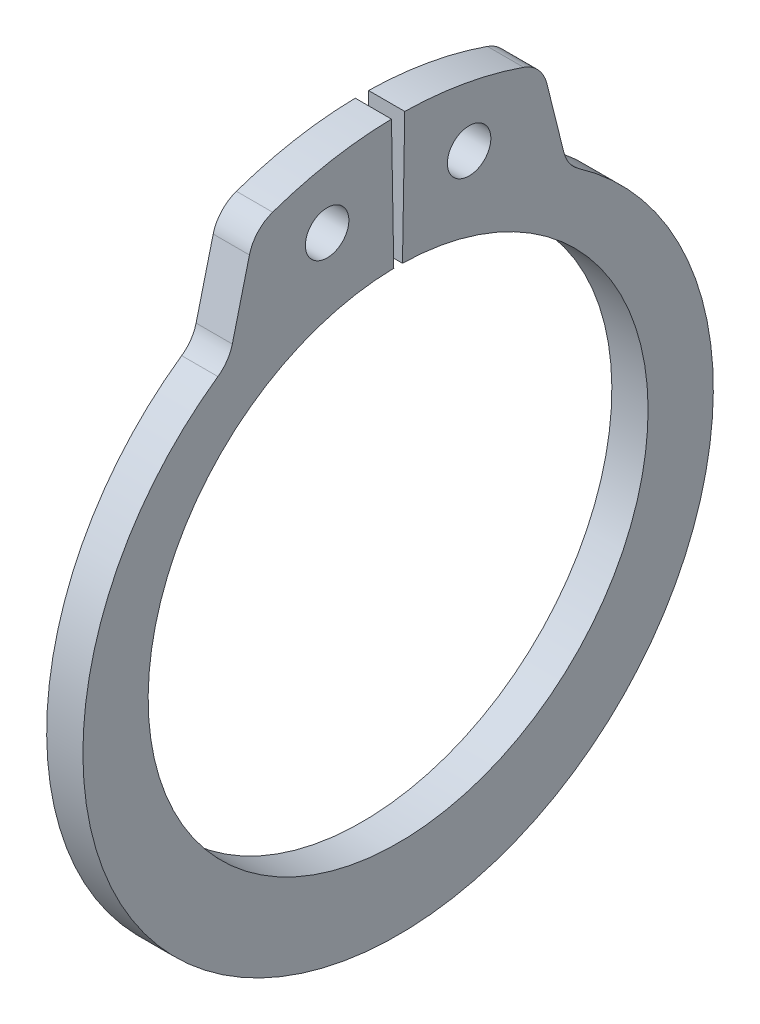
ISO-10303-21;
HEADER;
FILE_DESCRIPTION(('STEP AP214'),'2;1');
FILE_NAME('part.step','',(''),(''),'','','');
FILE_SCHEMA(('AUTOMOTIVE_DESIGN { 1 0 10303 214 1 1 1 1 }'));
ENDSEC;
DATA;
#1=APPLICATION_CONTEXT('core data for automotive mechanical design processes');
#2=APPLICATION_PROTOCOL_DEFINITION('international standard','automotive_design',2000,#1);
#3=PRODUCT_CONTEXT('',#1,'mechanical');
#4=PRODUCT('Part','Part','',(#3));
#5=PRODUCT_RELATED_PRODUCT_CATEGORY('part','',(#4));
#6=PRODUCT_DEFINITION_FORMATION('','',#4);
#7=PRODUCT_DEFINITION_CONTEXT('part definition',#1,'design');
#8=PRODUCT_DEFINITION('design','',#6,#7);
#9=PRODUCT_DEFINITION_SHAPE('','',#8);
#10=(LENGTH_UNIT() NAMED_UNIT(*) SI_UNIT(.MILLI.,.METRE.));
#11=(NAMED_UNIT(*) PLANE_ANGLE_UNIT() SI_UNIT($,.RADIAN.));
#12=(NAMED_UNIT(*) SI_UNIT($,.STERADIAN.) SOLID_ANGLE_UNIT());
#13=UNCERTAINTY_MEASURE_WITH_UNIT(LENGTH_MEASURE(1.E-05),#10,'distance_accuracy_value','');
#14=(GEOMETRIC_REPRESENTATION_CONTEXT(3) GLOBAL_UNCERTAINTY_ASSIGNED_CONTEXT((#13)) GLOBAL_UNIT_ASSIGNED_CONTEXT((#10,
#11,#12)) REPRESENTATION_CONTEXT('',''));
#15=CARTESIAN_POINT('',(0.,0.,0.));
#16=DIRECTION('',(0.,0.,1.));
#17=DIRECTION('',(1.,0.,0.));
#18=AXIS2_PLACEMENT_3D('',#15,#16,#17);
#19=CARTESIAN_POINT('',(-0.5,0.,0.));
#20=DIRECTION('',(1.,0.,0.));
#21=DIRECTION('',(0.,0.,-1.));
#22=AXIS2_PLACEMENT_3D('',#19,#20,#21);
#23=PLANE('',#22);
#24=CARTESIAN_POINT('',(-0.5,8.66711980549086,-1.9596288316201));
#25=DIRECTION('',(-1.,0.,0.));
#26=DIRECTION('',(0.,0.,1.));
#27=AXIS2_PLACEMENT_3D('',#24,#25,#26);
#28=CIRCLE('',#27,0.6);
#29=CARTESIAN_POINT('',(-0.5,8.66711980549086,-1.3596288316201));
#30=VERTEX_POINT('',#29);
#31=EDGE_CURVE('E125',#30,#30,#28,.F.);
#32=ORIENTED_EDGE('',*,*,#31,.T.);
#33=EDGE_LOOP('',(#32));
#34=FACE_BOUND('',#33,.T.);
#35=CARTESIAN_POINT('',(-0.5,8.66711980549086,1.9596288316201));
#36=DIRECTION('',(-1.,0.,0.));
#37=DIRECTION('',(0.,0.,1.));
#38=AXIS2_PLACEMENT_3D('',#35,#36,#37);
#39=CIRCLE('',#38,0.6);
#40=CARTESIAN_POINT('',(-0.5,8.66711980549086,2.5596288316201));
#41=VERTEX_POINT('',#40);
#42=EDGE_CURVE('E20',#41,#41,#39,.F.);
#43=ORIENTED_EDGE('',*,*,#42,.T.);
#44=EDGE_LOOP('',(#43));
#45=FACE_BOUND('',#44,.T.);
#46=CARTESIAN_POINT('',(-0.5,8.96816184312502,3.13401869099666));
#47=DIRECTION('',(-1.,0.,0.));
#48=DIRECTION('',(0.,0.,1.));
#49=AXIS2_PLACEMENT_3D('',#46,#47,#48);
#50=CIRCLE('',#49,1.);
#51=CARTESIAN_POINT('',(-0.5,9.91217887924345,3.46391539531209));
#52=VERTEX_POINT('',#51);
#53=CARTESIAN_POINT('',(-0.5,9.21008373872469,4.10431441727265));
#54=VERTEX_POINT('',#53);
#55=EDGE_CURVE('E111',#52,#54,#50,.F.);
#56=ORIENTED_EDGE('',*,*,#55,.F.);
#57=CARTESIAN_POINT('',(-0.5,0.,0.));
#58=DIRECTION('',(-1.,0.,0.));
#59=DIRECTION('',(0.,0.,1.));
#60=AXIS2_PLACEMENT_3D('',#57,#58,#59);
#61=CIRCLE('',#60,10.5);
#62=CARTESIAN_POINT('',(-0.5,10.4984007991421,0.183250267591477));
#63=VERTEX_POINT('',#62);
#64=EDGE_CURVE('E105',#63,#52,#61,.F.);
#65=ORIENTED_EDGE('',*,*,#64,.F.);
#66=DIRECTION('',(0.,-0.999847695156391,-0.0174524064372835));
#67=VECTOR('',#66,1.);
#68=CARTESIAN_POINT('',(-0.5,6.8989490965791,0.120421604417256));
#69=LINE('',#68,#67);
#70=CARTESIAN_POINT('',(-0.5,6.8989490965791,0.120421604417256));
#71=VERTEX_POINT('',#70);
#72=EDGE_CURVE('E108',#63,#71,#69,.T.);
#73=ORIENTED_EDGE('',*,*,#72,.T.);
#74=CARTESIAN_POINT('',(-0.5,0.,0.));
#75=DIRECTION('',(-1.,0.,0.));
#76=DIRECTION('',(0.,0.,1.));
#77=AXIS2_PLACEMENT_3D('',#74,#75,#76);
#78=CIRCLE('',#77,6.9);
#79=CARTESIAN_POINT('',(-0.5,6.8989490965791,-0.120421604417256));
#80=VERTEX_POINT('',#79);
#81=EDGE_CURVE('E171',#71,#80,#78,.F.);
#82=ORIENTED_EDGE('',*,*,#81,.T.);
#83=DIRECTION('',(0.,0.999847695156391,-0.0174524064372841));
#84=VECTOR('',#83,1.);
#85=CARTESIAN_POINT('',(-0.5,10.4984007991421,-0.183250267591479));
#86=LINE('',#85,#84);
#87=CARTESIAN_POINT('',(-0.5,10.4984007991421,-0.183250267591479));
#88=VERTEX_POINT('',#87);
#89=EDGE_CURVE('E133',#80,#88,#86,.T.);
#90=ORIENTED_EDGE('',*,*,#89,.T.);
#91=CARTESIAN_POINT('',(-0.5,0.,0.));
#92=DIRECTION('',(-1.,0.,0.));
#93=DIRECTION('',(0.,0.,1.));
#94=AXIS2_PLACEMENT_3D('',#91,#92,#93);
#95=CIRCLE('',#94,10.5);
#96=CARTESIAN_POINT('',(-0.5,9.91217887924345,-3.46391539531209));
#97=VERTEX_POINT('',#96);
#98=EDGE_CURVE('E173',#97,#88,#95,.F.);
#99=ORIENTED_EDGE('',*,*,#98,.F.);
#100=CARTESIAN_POINT('',(-0.5,8.96816184312502,-3.13401869099666));
#101=DIRECTION('',(-1.,0.,0.));
#102=DIRECTION('',(0.,0.,1.));
#103=AXIS2_PLACEMENT_3D('',#100,#101,#102);
#104=CIRCLE('',#103,1.);
#105=CARTESIAN_POINT('',(-0.5,9.21008373872469,-4.10431441727265));
#106=VERTEX_POINT('',#105);
#107=EDGE_CURVE('E176',#106,#97,#104,.F.);
#108=ORIENTED_EDGE('',*,*,#107,.F.);
#109=DIRECTION('',(0.,-0.970295726275997,-0.241921895599666));
#110=VECTOR('',#109,1.);
#111=CARTESIAN_POINT('',(-0.5,9.71734472745919,-3.97784004803122));
#112=LINE('',#111,#110);
#113=CARTESIAN_POINT('',(-0.5,7.31761530924591,-4.57615979123836));
#114=VERTEX_POINT('',#113);
#115=EDGE_CURVE('E138',#106,#114,#112,.T.);
#116=ORIENTED_EDGE('',*,*,#115,.T.);
#117=CARTESIAN_POINT('',(-0.5,7.55953720484558,-5.54645551751436));
#118=DIRECTION('',(-1.,0.,0.));
#119=DIRECTION('',(0.,0.,1.));
#120=AXIS2_PLACEMENT_3D('',#117,#118,#119);
#121=CIRCLE('',#120,1.);
#122=CARTESIAN_POINT('',(-0.5,6.73911195964233,-4.97470170945253));
#123=VERTEX_POINT('',#122);
#124=EDGE_CURVE('E178',#114,#123,#121,.F.);
#125=ORIENTED_EDGE('',*,*,#124,.T.);
#126=CARTESIAN_POINT('',(-0.5,-0.399224177769538,0.));
#127=DIRECTION('',(-1.,0.,0.));
#128=DIRECTION('',(0.,0.,1.));
#129=AXIS2_PLACEMENT_3D('',#126,#127,#128);
#130=CIRCLE('',#129,8.70077582223046);
#131=CARTESIAN_POINT('',(-0.5,6.73911195964233,4.97470170945253));
#132=VERTEX_POINT('',#131);
#133=EDGE_CURVE('E181',#132,#123,#130,.F.);
#134=ORIENTED_EDGE('',*,*,#133,.F.);
#135=CARTESIAN_POINT('',(-0.5,7.55953720484558,5.54645551751436));
#136=DIRECTION('',(-1.,0.,0.));
#137=DIRECTION('',(0.,0.,1.));
#138=AXIS2_PLACEMENT_3D('',#135,#136,#137);
#139=CIRCLE('',#138,1.);
#140=CARTESIAN_POINT('',(-0.5,7.31761530924591,4.57615979123836));
#141=VERTEX_POINT('',#140);
#142=EDGE_CURVE('E144',#132,#141,#139,.F.);
#143=ORIENTED_EDGE('',*,*,#142,.T.);
#144=DIRECTION('',(0.,0.970295726275997,-0.241921895599665));
#145=VECTOR('',#144,1.);
#146=CARTESIAN_POINT('',(-0.5,9.71734472745919,3.97784004803122));
#147=LINE('',#146,#145);
#148=EDGE_CURVE('E143',#141,#54,#147,.T.);
#149=ORIENTED_EDGE('',*,*,#148,.T.);
#150=EDGE_LOOP('',(#56,#65,#73,#82,#90,#99,#108,#116,#125,#134,#143,#149));
#151=FACE_BOUND('',#150,.T.);
#152=ADVANCED_FACE('F17',(#34,#45,#151),#23,.F.);
#153=CARTESIAN_POINT('',(0.5,8.66711980549086,1.9596288316201));
#154=DIRECTION('',(-1.,0.,0.));
#155=DIRECTION('',(0.,0.,1.));
#156=AXIS2_PLACEMENT_3D('',#153,#154,#155);
#157=CYLINDRICAL_SURFACE('',#156,0.6);
#158=CARTESIAN_POINT('',(0.5,8.66711980549086,1.9596288316201));
#159=DIRECTION('',(-1.,0.,0.));
#160=DIRECTION('',(0.,0.,1.));
#161=AXIS2_PLACEMENT_3D('',#158,#159,#160);
#162=CIRCLE('',#161,0.6);
#163=CARTESIAN_POINT('',(0.5,8.66711980549086,2.5596288316201));
#164=VERTEX_POINT('',#163);
#165=EDGE_CURVE('E128',#164,#164,#162,.T.);
#166=ORIENTED_EDGE('',*,*,#165,.F.);
#167=EDGE_LOOP('',(#166));
#168=FACE_BOUND('',#167,.T.);
#169=ORIENTED_EDGE('',*,*,#42,.F.);
#170=EDGE_LOOP('',(#169));
#171=FACE_BOUND('',#170,.T.);
#172=ADVANCED_FACE('F272',(#168,#171),#157,.F.);
#173=CARTESIAN_POINT('',(0.5,0.,0.));
#174=DIRECTION('',(-1.,0.,0.));
#175=DIRECTION('',(0.,0.,1.));
#176=AXIS2_PLACEMENT_3D('',#173,#174,#175);
#177=CYLINDRICAL_SURFACE('',#176,10.5);
#178=CARTESIAN_POINT('',(0.5,0.,0.));
#179=DIRECTION('',(-1.,0.,0.));
#180=DIRECTION('',(0.,0.,1.));
#181=AXIS2_PLACEMENT_3D('',#178,#179,#180);
#182=CIRCLE('',#181,10.5);
#183=CARTESIAN_POINT('',(0.5,10.4984007991421,0.183250267591477));
#184=VERTEX_POINT('',#183);
#185=CARTESIAN_POINT('',(0.5,9.91217887924345,3.46391539531209));
#186=VERTEX_POINT('',#185);
#187=EDGE_CURVE('E119',#184,#186,#182,.F.);
#188=ORIENTED_EDGE('',*,*,#187,.F.);
#189=DIRECTION('',(1.,0.,0.));
#190=VECTOR('',#189,1.);
#191=CARTESIAN_POINT('',(0.5,10.4984007991421,0.183250267591477));
#192=LINE('',#191,#190);
#193=EDGE_CURVE('E116',#184,#63,#192,.F.);
#194=ORIENTED_EDGE('',*,*,#193,.T.);
#195=ORIENTED_EDGE('',*,*,#64,.T.);
#196=DIRECTION('',(-1.,0.,0.));
#197=VECTOR('',#196,1.);
#198=CARTESIAN_POINT('',(0.5,9.91217887924345,3.46391539531209));
#199=LINE('',#198,#197);
#200=EDGE_CURVE('E114',#186,#52,#199,.T.);
#201=ORIENTED_EDGE('',*,*,#200,.F.);
#202=EDGE_LOOP('',(#188,#194,#195,#201));
#203=FACE_BOUND('',#202,.T.);
#204=ADVANCED_FACE('F117',(#203),#177,.T.);
#205=CARTESIAN_POINT('',(0.5,8.96816184312502,3.13401869099666));
#206=DIRECTION('',(-1.,0.,0.));
#207=DIRECTION('',(0.,0.,1.));
#208=AXIS2_PLACEMENT_3D('',#205,#206,#207);
#209=CYLINDRICAL_SURFACE('',#208,1.);
#210=ORIENTED_EDGE('',*,*,#55,.T.);
#211=DIRECTION('',(1.,0.,0.));
#212=VECTOR('',#211,1.);
#213=CARTESIAN_POINT('',(0.5,9.21008373872469,4.10431441727265));
#214=LINE('',#213,#212);
#215=CARTESIAN_POINT('',(0.5,9.21008373872469,4.10431441727265));
#216=VERTEX_POINT('',#215);
#217=EDGE_CURVE('E145',#54,#216,#214,.T.);
#218=ORIENTED_EDGE('',*,*,#217,.T.);
#219=CARTESIAN_POINT('',(0.5,8.96816184312502,3.13401869099666));
#220=DIRECTION('',(-1.,0.,0.));
#221=DIRECTION('',(0.,0.,1.));
#222=AXIS2_PLACEMENT_3D('',#219,#220,#221);
#223=CIRCLE('',#222,1.);
#224=EDGE_CURVE('E165',#186,#216,#223,.F.);
#225=ORIENTED_EDGE('',*,*,#224,.F.);
#226=ORIENTED_EDGE('',*,*,#200,.T.);
#227=EDGE_LOOP('',(#210,#218,#225,#226));
#228=FACE_BOUND('',#227,.T.);
#229=ADVANCED_FACE('F189',(#228),#209,.T.);
#230=CARTESIAN_POINT('',(0.5,9.71734472745919,3.97784004803122));
#231=DIRECTION('',(0.,-0.241921895599665,-0.970295726275997));
#232=DIRECTION('',(0.,0.970295726275997,-0.241921895599665));
#233=AXIS2_PLACEMENT_3D('',#230,#231,#232);
#234=PLANE('',#233);
#235=DIRECTION('',(-1.,0.,0.));
#236=VECTOR('',#235,1.);
#237=CARTESIAN_POINT('',(0.5,7.31761530924591,4.57615979123836));
#238=LINE('',#237,#236);
#239=CARTESIAN_POINT('',(0.5,7.31761530924591,4.57615979123836));
#240=VERTEX_POINT('',#239);
#241=EDGE_CURVE('E186',#141,#240,#238,.F.);
#242=ORIENTED_EDGE('',*,*,#241,.T.);
#243=DIRECTION('',(0.,-0.970295726275997,0.241921895599665));
#244=VECTOR('',#243,1.);
#245=CARTESIAN_POINT('',(0.5,9.21008373872469,4.10431441727265));
#246=LINE('',#245,#244);
#247=EDGE_CURVE('E164',#216,#240,#246,.T.);
#248=ORIENTED_EDGE('',*,*,#247,.F.);
#249=ORIENTED_EDGE('',*,*,#217,.F.);
#250=ORIENTED_EDGE('',*,*,#148,.F.);
#251=EDGE_LOOP('',(#242,#248,#249,#250));
#252=FACE_BOUND('',#251,.T.);
#253=ADVANCED_FACE('F217',(#252),#234,.F.);
#254=CARTESIAN_POINT('',(0.5,7.55953720484558,5.54645551751436));
#255=DIRECTION('',(-1.,0.,0.));
#256=DIRECTION('',(0.,0.,1.));
#257=AXIS2_PLACEMENT_3D('',#254,#255,#256);
#258=CYLINDRICAL_SURFACE('',#257,1.);
#259=ORIENTED_EDGE('',*,*,#241,.F.);
#260=ORIENTED_EDGE('',*,*,#142,.F.);
#261=DIRECTION('',(-1.,0.,0.));
#262=VECTOR('',#261,1.);
#263=CARTESIAN_POINT('',(0.5,6.73911195964233,4.97470170945253));
#264=LINE('',#263,#262);
#265=CARTESIAN_POINT('',(0.5,6.73911195964233,4.97470170945253));
#266=VERTEX_POINT('',#265);
#267=EDGE_CURVE('E184',#266,#132,#264,.T.);
#268=ORIENTED_EDGE('',*,*,#267,.F.);
#269=CARTESIAN_POINT('',(0.5,7.55953720484558,5.54645551751436));
#270=DIRECTION('',(-1.,0.,0.));
#271=DIRECTION('',(0.,0.,1.));
#272=AXIS2_PLACEMENT_3D('',#269,#270,#271);
#273=CIRCLE('',#272,1.);
#274=EDGE_CURVE('E161',#240,#266,#273,.T.);
#275=ORIENTED_EDGE('',*,*,#274,.F.);
#276=EDGE_LOOP('',(#259,#260,#268,#275));
#277=FACE_BOUND('',#276,.T.);
#278=ADVANCED_FACE('F220',(#277),#258,.F.);
#279=CARTESIAN_POINT('',(0.5,-0.399224177769538,0.));
#280=DIRECTION('',(-1.,0.,0.));
#281=DIRECTION('',(0.,0.,1.));
#282=AXIS2_PLACEMENT_3D('',#279,#280,#281);
#283=CYLINDRICAL_SURFACE('',#282,8.70077582223046);
#284=ORIENTED_EDGE('',*,*,#133,.T.);
#285=DIRECTION('',(-1.,0.,0.));
#286=VECTOR('',#285,1.);
#287=CARTESIAN_POINT('',(0.5,6.73911195964233,-4.97470170945253));
#288=LINE('',#287,#286);
#289=CARTESIAN_POINT('',(0.5,6.73911195964233,-4.97470170945253));
#290=VERTEX_POINT('',#289);
#291=EDGE_CURVE('E180',#123,#290,#288,.F.);
#292=ORIENTED_EDGE('',*,*,#291,.T.);
#293=CARTESIAN_POINT('',(0.5,-0.399224177769538,0.));
#294=DIRECTION('',(-1.,0.,0.));
#295=DIRECTION('',(0.,0.,1.));
#296=AXIS2_PLACEMENT_3D('',#293,#294,#295);
#297=CIRCLE('',#296,8.70077582223046);
#298=EDGE_CURVE('E159',#266,#290,#297,.F.);
#299=ORIENTED_EDGE('',*,*,#298,.F.);
#300=ORIENTED_EDGE('',*,*,#267,.T.);
#301=EDGE_LOOP('',(#284,#292,#299,#300));
#302=FACE_BOUND('',#301,.T.);
#303=ADVANCED_FACE('F225',(#302),#283,.T.);
#304=CARTESIAN_POINT('',(0.5,7.55953720484558,-5.54645551751436));
#305=DIRECTION('',(-1.,0.,0.));
#306=DIRECTION('',(0.,0.,1.));
#307=AXIS2_PLACEMENT_3D('',#304,#305,#306);
#308=CYLINDRICAL_SURFACE('',#307,1.);
#309=ORIENTED_EDGE('',*,*,#291,.F.);
#310=ORIENTED_EDGE('',*,*,#124,.F.);
#311=DIRECTION('',(1.,0.,0.));
#312=VECTOR('',#311,1.);
#313=CARTESIAN_POINT('',(0.5,7.31761530924591,-4.57615979123836));
#314=LINE('',#313,#312);
#315=CARTESIAN_POINT('',(0.5,7.31761530924591,-4.57615979123836));
#316=VERTEX_POINT('',#315);
#317=EDGE_CURVE('E142',#114,#316,#314,.T.);
#318=ORIENTED_EDGE('',*,*,#317,.T.);
#319=CARTESIAN_POINT('',(0.5,7.55953720484558,-5.54645551751436));
#320=DIRECTION('',(-1.,0.,0.));
#321=DIRECTION('',(0.,0.,1.));
#322=AXIS2_PLACEMENT_3D('',#319,#320,#321);
#323=CIRCLE('',#322,1.);
#324=EDGE_CURVE('E156',#290,#316,#323,.T.);
#325=ORIENTED_EDGE('',*,*,#324,.F.);
#326=EDGE_LOOP('',(#309,#310,#318,#325));
#327=FACE_BOUND('',#326,.T.);
#328=ADVANCED_FACE('F227',(#327),#308,.F.);
#329=CARTESIAN_POINT('',(0.5,9.71734472745919,-3.97784004803122));
#330=DIRECTION('',(0.,-0.241921895599666,0.970295726275997));
#331=DIRECTION('',(0.,-0.970295726275997,-0.241921895599666));
#332=AXIS2_PLACEMENT_3D('',#329,#330,#331);
#333=PLANE('',#332);
#334=DIRECTION('',(-1.,0.,0.));
#335=VECTOR('',#334,1.);
#336=CARTESIAN_POINT('',(0.5,9.21008373872469,-4.10431441727265));
#337=LINE('',#336,#335);
#338=CARTESIAN_POINT('',(0.5,9.21008373872469,-4.10431441727265));
#339=VERTEX_POINT('',#338);
#340=EDGE_CURVE('E141',#339,#106,#337,.T.);
#341=ORIENTED_EDGE('',*,*,#340,.F.);
#342=DIRECTION('',(0.,0.970295726275997,0.241921895599666));
#343=VECTOR('',#342,1.);
#344=CARTESIAN_POINT('',(0.5,7.31761530924591,-4.57615979123836));
#345=LINE('',#344,#343);
#346=EDGE_CURVE('E155',#316,#339,#345,.T.);
#347=ORIENTED_EDGE('',*,*,#346,.F.);
#348=ORIENTED_EDGE('',*,*,#317,.F.);
#349=ORIENTED_EDGE('',*,*,#115,.F.);
#350=EDGE_LOOP('',(#341,#347,#348,#349));
#351=FACE_BOUND('',#350,.T.);
#352=ADVANCED_FACE('F231',(#351),#333,.F.);
#353=CARTESIAN_POINT('',(0.5,8.96816184312502,-3.13401869099666));
#354=DIRECTION('',(-1.,0.,0.));
#355=DIRECTION('',(0.,0.,1.));
#356=AXIS2_PLACEMENT_3D('',#353,#354,#355);
#357=CYLINDRICAL_SURFACE('',#356,1.);
#358=ORIENTED_EDGE('',*,*,#107,.T.);
#359=DIRECTION('',(-1.,0.,0.));
#360=VECTOR('',#359,1.);
#361=CARTESIAN_POINT('',(0.5,9.91217887924345,-3.46391539531209));
#362=LINE('',#361,#360);
#363=CARTESIAN_POINT('',(0.5,9.91217887924345,-3.46391539531209));
#364=VERTEX_POINT('',#363);
#365=EDGE_CURVE('E175',#364,#97,#362,.T.);
#366=ORIENTED_EDGE('',*,*,#365,.F.);
#367=CARTESIAN_POINT('',(0.5,8.96816184312502,-3.13401869099666));
#368=DIRECTION('',(-1.,0.,0.));
#369=DIRECTION('',(0.,0.,1.));
#370=AXIS2_PLACEMENT_3D('',#367,#368,#369);
#371=CIRCLE('',#370,1.);
#372=EDGE_CURVE('E152',#339,#364,#371,.F.);
#373=ORIENTED_EDGE('',*,*,#372,.F.);
#374=ORIENTED_EDGE('',*,*,#340,.T.);
#375=EDGE_LOOP('',(#358,#366,#373,#374));
#376=FACE_BOUND('',#375,.T.);
#377=ADVANCED_FACE('F235',(#376),#357,.T.);
#378=CARTESIAN_POINT('',(0.5,0.,0.));
#379=DIRECTION('',(-1.,0.,0.));
#380=DIRECTION('',(0.,0.,1.));
#381=AXIS2_PLACEMENT_3D('',#378,#379,#380);
#382=CYLINDRICAL_SURFACE('',#381,10.5);
#383=ORIENTED_EDGE('',*,*,#98,.T.);
#384=DIRECTION('',(1.,0.,0.));
#385=VECTOR('',#384,1.);
#386=CARTESIAN_POINT('',(0.5,10.4984007991421,-0.183250267591479));
#387=LINE('',#386,#385);
#388=CARTESIAN_POINT('',(0.5,10.4984007991421,-0.183250267591479));
#389=VERTEX_POINT('',#388);
#390=EDGE_CURVE('E137',#88,#389,#387,.T.);
#391=ORIENTED_EDGE('',*,*,#390,.T.);
#392=CARTESIAN_POINT('',(0.5,0.,0.));
#393=DIRECTION('',(-1.,0.,0.));
#394=DIRECTION('',(0.,0.,1.));
#395=AXIS2_PLACEMENT_3D('',#392,#393,#394);
#396=CIRCLE('',#395,10.5);
#397=EDGE_CURVE('E149',#364,#389,#396,.F.);
#398=ORIENTED_EDGE('',*,*,#397,.F.);
#399=ORIENTED_EDGE('',*,*,#365,.T.);
#400=EDGE_LOOP('',(#383,#391,#398,#399));
#401=FACE_BOUND('',#400,.T.);
#402=ADVANCED_FACE('F239',(#401),#382,.T.);
#403=CARTESIAN_POINT('',(0.5,10.4984007991421,-0.183250267591479));
#404=DIRECTION('',(0.,-0.0174524064372841,-0.999847695156391));
#405=DIRECTION('',(0.,0.999847695156391,-0.0174524064372841));
#406=AXIS2_PLACEMENT_3D('',#403,#404,#405);
#407=PLANE('',#406);
#408=DIRECTION('',(-1.,0.,0.));
#409=VECTOR('',#408,1.);
#410=CARTESIAN_POINT('',(0.5,6.8989490965791,-0.120421604417256));
#411=LINE('',#410,#409);
#412=CARTESIAN_POINT('',(0.5,6.8989490965791,-0.120421604417256));
#413=VERTEX_POINT('',#412);
#414=EDGE_CURVE('E136',#80,#413,#411,.F.);
#415=ORIENTED_EDGE('',*,*,#414,.T.);
#416=DIRECTION('',(0.,-0.999847695156391,0.017452406437284));
#417=VECTOR('',#416,1.);
#418=CARTESIAN_POINT('',(0.5,10.4984007991421,-0.183250267591479));
#419=LINE('',#418,#417);
#420=EDGE_CURVE('E148',#389,#413,#419,.T.);
#421=ORIENTED_EDGE('',*,*,#420,.F.);
#422=ORIENTED_EDGE('',*,*,#390,.F.);
#423=ORIENTED_EDGE('',*,*,#89,.F.);
#424=EDGE_LOOP('',(#415,#421,#422,#423));
#425=FACE_BOUND('',#424,.T.);
#426=ADVANCED_FACE('F244',(#425),#407,.F.);
#427=CARTESIAN_POINT('',(0.5,0.,0.));
#428=DIRECTION('',(-1.,0.,0.));
#429=DIRECTION('',(0.,0.,1.));
#430=AXIS2_PLACEMENT_3D('',#427,#428,#429);
#431=CYLINDRICAL_SURFACE('',#430,6.9);
#432=DIRECTION('',(1.,0.,0.));
#433=VECTOR('',#432,1.);
#434=CARTESIAN_POINT('',(0.5,6.8989490965791,0.120421604417256));
#435=LINE('',#434,#433);
#436=CARTESIAN_POINT('',(0.5,6.8989490965791,0.120421604417256));
#437=VERTEX_POINT('',#436);
#438=EDGE_CURVE('E122',#71,#437,#435,.T.);
#439=ORIENTED_EDGE('',*,*,#438,.T.);
#440=CARTESIAN_POINT('',(0.5,0.,0.));
#441=DIRECTION('',(-1.,0.,0.));
#442=DIRECTION('',(0.,0.,1.));
#443=AXIS2_PLACEMENT_3D('',#440,#441,#442);
#444=CIRCLE('',#443,6.9);
#445=EDGE_CURVE('E35',#413,#437,#444,.T.);
#446=ORIENTED_EDGE('',*,*,#445,.F.);
#447=ORIENTED_EDGE('',*,*,#414,.F.);
#448=ORIENTED_EDGE('',*,*,#81,.F.);
#449=EDGE_LOOP('',(#439,#446,#447,#448));
#450=FACE_BOUND('',#449,.T.);
#451=ADVANCED_FACE('F247',(#450),#431,.F.);
#452=CARTESIAN_POINT('',(0.5,6.8989490965791,0.120421604417256));
#453=DIRECTION('',(0.,-0.0174524064372835,0.999847695156391));
#454=DIRECTION('',(0.,-0.999847695156391,-0.0174524064372835));
#455=AXIS2_PLACEMENT_3D('',#452,#453,#454);
#456=PLANE('',#455);
#457=ORIENTED_EDGE('',*,*,#193,.F.);
#458=DIRECTION('',(0.,0.999847695156391,0.0174524064372835));
#459=VECTOR('',#458,1.);
#460=CARTESIAN_POINT('',(0.5,6.8989490965791,0.120421604417256));
#461=LINE('',#460,#459);
#462=EDGE_CURVE('E26',#437,#184,#461,.T.);
#463=ORIENTED_EDGE('',*,*,#462,.F.);
#464=ORIENTED_EDGE('',*,*,#438,.F.);
#465=ORIENTED_EDGE('',*,*,#72,.F.);
#466=EDGE_LOOP('',(#457,#463,#464,#465));
#467=FACE_BOUND('',#466,.T.);
#468=ADVANCED_FACE('F124',(#467),#456,.F.);
#469=CARTESIAN_POINT('',(0.5,8.66711980549086,-1.9596288316201));
#470=DIRECTION('',(-1.,0.,0.));
#471=DIRECTION('',(0.,0.,1.));
#472=AXIS2_PLACEMENT_3D('',#469,#470,#471);
#473=CYLINDRICAL_SURFACE('',#472,0.6);
#474=CARTESIAN_POINT('',(0.5,8.66711980549086,-1.9596288316201));
#475=DIRECTION('',(-1.,0.,0.));
#476=DIRECTION('',(0.,0.,1.));
#477=AXIS2_PLACEMENT_3D('',#474,#475,#476);
#478=CIRCLE('',#477,0.6);
#479=CARTESIAN_POINT('',(0.5,8.66711980549086,-1.3596288316201));
#480=VERTEX_POINT('',#479);
#481=EDGE_CURVE('E11',#480,#480,#478,.T.);
#482=ORIENTED_EDGE('',*,*,#481,.F.);
#483=EDGE_LOOP('',(#482));
#484=FACE_BOUND('',#483,.T.);
#485=ORIENTED_EDGE('',*,*,#31,.F.);
#486=EDGE_LOOP('',(#485));
#487=FACE_BOUND('',#486,.T.);
#488=ADVANCED_FACE('F255',(#484,#487),#473,.F.);
#489=CARTESIAN_POINT('',(0.5,0.,0.));
#490=DIRECTION('',(1.,0.,0.));
#491=DIRECTION('',(0.,0.,-1.));
#492=AXIS2_PLACEMENT_3D('',#489,#490,#491);
#493=PLANE('',#492);
#494=ORIENTED_EDGE('',*,*,#481,.T.);
#495=EDGE_LOOP('',(#494));
#496=FACE_BOUND('',#495,.T.);
#497=ORIENTED_EDGE('',*,*,#445,.T.);
#498=ORIENTED_EDGE('',*,*,#462,.T.);
#499=ORIENTED_EDGE('',*,*,#187,.T.);
#500=ORIENTED_EDGE('',*,*,#224,.T.);
#501=ORIENTED_EDGE('',*,*,#247,.T.);
#502=ORIENTED_EDGE('',*,*,#274,.T.);
#503=ORIENTED_EDGE('',*,*,#298,.T.);
#504=ORIENTED_EDGE('',*,*,#324,.T.);
#505=ORIENTED_EDGE('',*,*,#346,.T.);
#506=ORIENTED_EDGE('',*,*,#372,.T.);
#507=ORIENTED_EDGE('',*,*,#397,.T.);
#508=ORIENTED_EDGE('',*,*,#420,.T.);
#509=EDGE_LOOP('',(#497,#498,#499,#500,#501,#502,#503,#504,#505,#506,#507,#508));
#510=FACE_BOUND('',#509,.T.);
#511=ORIENTED_EDGE('',*,*,#165,.T.);
#512=EDGE_LOOP('',(#511));
#513=FACE_BOUND('',#512,.T.);
#514=ADVANCED_FACE('F193',(#496,#510,#513),#493,.T.);
#515=CLOSED_SHELL('',(#152,#172,#204,#229,#253,#278,#303,#328,#352,#377,#402,#426,#451,#468,
#488,#514));
#516=MANIFOLD_SOLID_BREP('B1',#515);
#517=ADVANCED_BREP_SHAPE_REPRESENTATION('',(#18,#516),#14);
#518=SHAPE_DEFINITION_REPRESENTATION(#9,#517);
ENDSEC;
END-ISO-10303-21;
